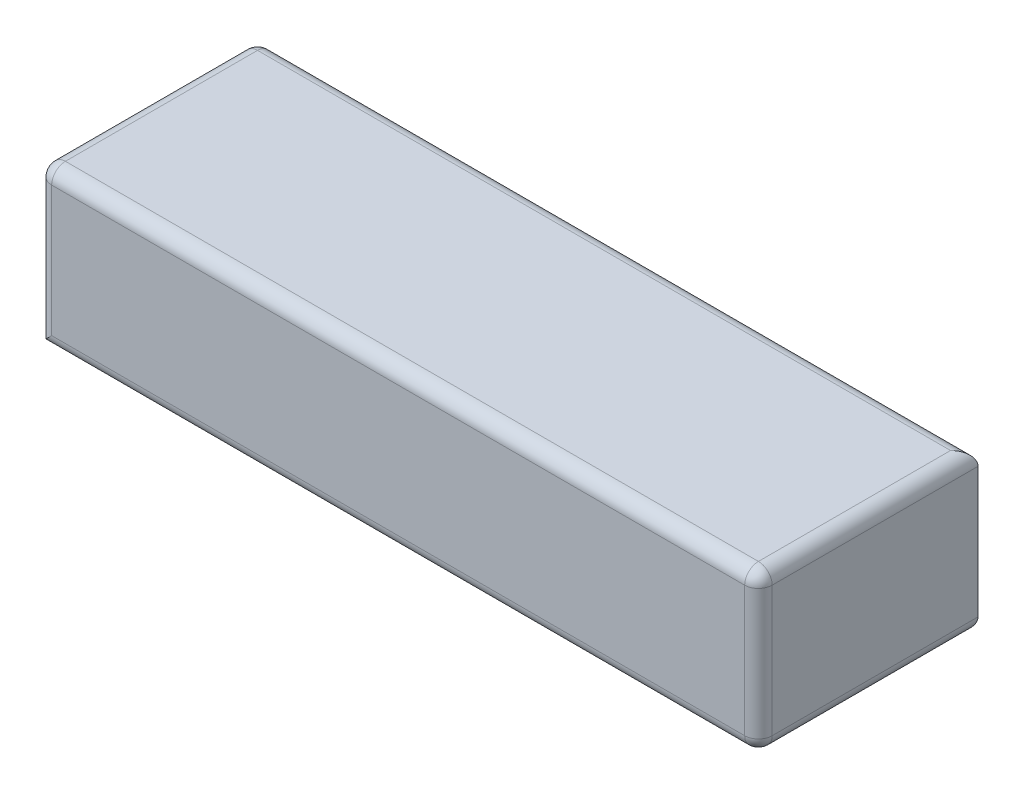
ISO-10303-21;
HEADER;
FILE_DESCRIPTION(('STEP AP214'),'2;1');
FILE_NAME('part.step','',(''),(''),'','','');
FILE_SCHEMA(('AUTOMOTIVE_DESIGN { 1 0 10303 214 1 1 1 1 }'));
ENDSEC;
DATA;
#1=APPLICATION_CONTEXT('core data for automotive mechanical design processes');
#2=APPLICATION_PROTOCOL_DEFINITION('international standard','automotive_design',2000,#1);
#3=PRODUCT_CONTEXT('',#1,'mechanical');
#4=PRODUCT('Part','Part','',(#3));
#5=PRODUCT_RELATED_PRODUCT_CATEGORY('part','',(#4));
#6=PRODUCT_DEFINITION_FORMATION('','',#4);
#7=PRODUCT_DEFINITION_CONTEXT('part definition',#1,'design');
#8=PRODUCT_DEFINITION('design','',#6,#7);
#9=PRODUCT_DEFINITION_SHAPE('','',#8);
#10=(LENGTH_UNIT() NAMED_UNIT(*) SI_UNIT(.MILLI.,.METRE.));
#11=(NAMED_UNIT(*) PLANE_ANGLE_UNIT() SI_UNIT($,.RADIAN.));
#12=(NAMED_UNIT(*) SI_UNIT($,.STERADIAN.) SOLID_ANGLE_UNIT());
#13=UNCERTAINTY_MEASURE_WITH_UNIT(LENGTH_MEASURE(1.E-05),#10,'distance_accuracy_value','');
#14=(GEOMETRIC_REPRESENTATION_CONTEXT(3) GLOBAL_UNCERTAINTY_ASSIGNED_CONTEXT((#13)) GLOBAL_UNIT_ASSIGNED_CONTEXT((#10,
#11,#12)) REPRESENTATION_CONTEXT('',''));
#15=CARTESIAN_POINT('',(0.,0.,0.));
#16=DIRECTION('',(0.,0.,1.));
#17=DIRECTION('',(1.,0.,0.));
#18=AXIS2_PLACEMENT_3D('',#15,#16,#17);
#19=CARTESIAN_POINT('',(52.5,23.,16.));
#20=DIRECTION('',(-1.,0.,0.));
#21=DIRECTION('',(0.,0.,1.));
#22=AXIS2_PLACEMENT_3D('',#19,#20,#21);
#23=PLANE('',#22);
#24=DIRECTION('',(0.,-1.,0.));
#25=VECTOR('',#24,1.);
#26=CARTESIAN_POINT('',(52.5,23.,-16.));
#27=LINE('',#26,#25);
#28=CARTESIAN_POINT('',(52.5,21.,-16.));
#29=VERTEX_POINT('',#28);
#30=CARTESIAN_POINT('',(52.5,2.,-16.));
#31=VERTEX_POINT('',#30);
#32=EDGE_CURVE('E140',#29,#31,#27,.T.);
#33=ORIENTED_EDGE('',*,*,#32,.F.);
#34=DIRECTION('',(0.,0.,-1.));
#35=VECTOR('',#34,1.);
#36=CARTESIAN_POINT('',(52.5,21.,16.));
#37=LINE('',#36,#35);
#38=CARTESIAN_POINT('',(52.5,21.,14.));
#39=VERTEX_POINT('',#38);
#40=EDGE_CURVE('E175',#29,#39,#37,.F.);
#41=ORIENTED_EDGE('',*,*,#40,.T.);
#42=DIRECTION('',(0.,-1.,0.));
#43=VECTOR('',#42,1.);
#44=CARTESIAN_POINT('',(52.5,23.,14.));
#45=LINE('',#44,#43);
#46=CARTESIAN_POINT('',(52.5,2.,14.));
#47=VERTEX_POINT('',#46);
#48=EDGE_CURVE('E173',#39,#47,#45,.T.);
#49=ORIENTED_EDGE('',*,*,#48,.T.);
#50=DIRECTION('',(0.,0.,-1.));
#51=VECTOR('',#50,1.);
#52=CARTESIAN_POINT('',(52.5,2.,-16.));
#53=LINE('',#52,#51);
#54=EDGE_CURVE('E171',#47,#31,#53,.T.);
#55=ORIENTED_EDGE('',*,*,#54,.T.);
#56=EDGE_LOOP('',(#33,#41,#49,#55));
#57=FACE_BOUND('',#56,.T.);
#58=ADVANCED_FACE('F34',(#57),#23,.F.);
#59=CARTESIAN_POINT('',(-52.5,23.,-16.));
#60=DIRECTION('',(0.,0.,1.));
#61=DIRECTION('',(1.,0.,0.));
#62=AXIS2_PLACEMENT_3D('',#59,#60,#61);
#63=PLANE('',#62);
#64=DIRECTION('',(0.,-1.,0.));
#65=VECTOR('',#64,1.);
#66=CARTESIAN_POINT('',(-50.5,23.,-16.));
#67=LINE('',#66,#65);
#68=CARTESIAN_POINT('',(-50.5,2.,-16.));
#69=VERTEX_POINT('',#68);
#70=CARTESIAN_POINT('',(-50.5,21.,-16.));
#71=VERTEX_POINT('',#70);
#72=EDGE_CURVE('E166',#69,#71,#67,.F.);
#73=ORIENTED_EDGE('',*,*,#72,.T.);
#74=DIRECTION('',(-1.,0.,0.));
#75=VECTOR('',#74,1.);
#76=CARTESIAN_POINT('',(-52.5,21.,-16.));
#77=LINE('',#76,#75);
#78=EDGE_CURVE('E168',#71,#29,#77,.F.);
#79=ORIENTED_EDGE('',*,*,#78,.T.);
#80=ORIENTED_EDGE('',*,*,#32,.T.);
#81=DIRECTION('',(-1.,0.,0.));
#82=VECTOR('',#81,1.);
#83=CARTESIAN_POINT('',(-52.5,2.,-16.));
#84=LINE('',#83,#82);
#85=EDGE_CURVE('E164',#31,#69,#84,.T.);
#86=ORIENTED_EDGE('',*,*,#85,.T.);
#87=EDGE_LOOP('',(#73,#79,#80,#86));
#88=FACE_BOUND('',#87,.T.);
#89=ADVANCED_FACE('F262',(#88),#63,.F.);
#90=CARTESIAN_POINT('',(-52.5,23.,16.));
#91=DIRECTION('',(1.,0.,0.));
#92=DIRECTION('',(0.,0.,-1.));
#93=AXIS2_PLACEMENT_3D('',#90,#91,#92);
#94=PLANE('',#93);
#95=DIRECTION('',(0.,0.,1.));
#96=VECTOR('',#95,1.);
#97=CARTESIAN_POINT('',(-52.5,21.,16.));
#98=LINE('',#97,#96);
#99=CARTESIAN_POINT('',(-52.5,21.,14.));
#100=VERTEX_POINT('',#99);
#101=CARTESIAN_POINT('',(-52.5,21.,-14.));
#102=VERTEX_POINT('',#101);
#103=EDGE_CURVE('E159',#100,#102,#98,.F.);
#104=ORIENTED_EDGE('',*,*,#103,.T.);
#105=DIRECTION('',(0.,-1.,0.));
#106=VECTOR('',#105,1.);
#107=CARTESIAN_POINT('',(-52.5,23.,-14.));
#108=LINE('',#107,#106);
#109=CARTESIAN_POINT('',(-52.5,0.,-14.));
#110=VERTEX_POINT('',#109);
#111=EDGE_CURVE('E162',#102,#110,#108,.T.);
#112=ORIENTED_EDGE('',*,*,#111,.T.);
#113=DIRECTION('',(0.,0.,1.));
#114=VECTOR('',#113,1.);
#115=CARTESIAN_POINT('',(-52.5,0.,16.));
#116=LINE('',#115,#114);
#117=CARTESIAN_POINT('',(-52.5,0.,14.));
#118=VERTEX_POINT('',#117);
#119=EDGE_CURVE('E211',#110,#118,#116,.T.);
#120=ORIENTED_EDGE('',*,*,#119,.T.);
#121=DIRECTION('',(0.,-1.,0.));
#122=VECTOR('',#121,1.);
#123=CARTESIAN_POINT('',(-52.5,23.,14.));
#124=LINE('',#123,#122);
#125=EDGE_CURVE('E157',#118,#100,#124,.F.);
#126=ORIENTED_EDGE('',*,*,#125,.T.);
#127=EDGE_LOOP('',(#104,#112,#120,#126));
#128=FACE_BOUND('',#127,.T.);
#129=ADVANCED_FACE('F264',(#128),#94,.F.);
#130=CARTESIAN_POINT('',(-52.5,23.,16.));
#131=DIRECTION('',(0.,0.,-1.));
#132=DIRECTION('',(-1.,0.,0.));
#133=AXIS2_PLACEMENT_3D('',#130,#131,#132);
#134=PLANE('',#133);
#135=DIRECTION('',(0.,-1.,0.));
#136=VECTOR('',#135,1.);
#137=CARTESIAN_POINT('',(50.5,23.,16.));
#138=LINE('',#137,#136);
#139=CARTESIAN_POINT('',(50.5,2.,16.));
#140=VERTEX_POINT('',#139);
#141=CARTESIAN_POINT('',(50.5,21.,16.));
#142=VERTEX_POINT('',#141);
#143=EDGE_CURVE('E146',#140,#142,#138,.F.);
#144=ORIENTED_EDGE('',*,*,#143,.T.);
#145=DIRECTION('',(1.,0.,0.));
#146=VECTOR('',#145,1.);
#147=CARTESIAN_POINT('',(-52.5,21.,16.));
#148=LINE('',#147,#146);
#149=CARTESIAN_POINT('',(-50.5,21.,16.));
#150=VERTEX_POINT('',#149);
#151=EDGE_CURVE('E118',#142,#150,#148,.F.);
#152=ORIENTED_EDGE('',*,*,#151,.T.);
#153=DIRECTION('',(0.,-1.,0.));
#154=VECTOR('',#153,1.);
#155=CARTESIAN_POINT('',(-50.5,23.,16.));
#156=LINE('',#155,#154);
#157=CARTESIAN_POINT('',(-50.5,2.,16.));
#158=VERTEX_POINT('',#157);
#159=EDGE_CURVE('E154',#150,#158,#156,.T.);
#160=ORIENTED_EDGE('',*,*,#159,.T.);
#161=DIRECTION('',(1.,0.,0.));
#162=VECTOR('',#161,1.);
#163=CARTESIAN_POINT('',(52.5,2.,16.));
#164=LINE('',#163,#162);
#165=EDGE_CURVE('E148',#158,#140,#164,.T.);
#166=ORIENTED_EDGE('',*,*,#165,.T.);
#167=EDGE_LOOP('',(#144,#152,#160,#166));
#168=FACE_BOUND('',#167,.T.);
#169=ADVANCED_FACE('F243',(#168),#134,.F.);
#170=CARTESIAN_POINT('',(0.,23.,0.));
#171=DIRECTION('',(0.,-1.,0.));
#172=DIRECTION('',(0.,0.,-1.));
#173=AXIS2_PLACEMENT_3D('',#170,#171,#172);
#174=PLANE('',#173);
#175=DIRECTION('',(0.,0.,1.));
#176=VECTOR('',#175,1.);
#177=CARTESIAN_POINT('',(-50.5,23.,0.));
#178=LINE('',#177,#176);
#179=CARTESIAN_POINT('',(-50.5,23.,-14.));
#180=VERTEX_POINT('',#179);
#181=CARTESIAN_POINT('',(-50.5,23.,14.));
#182=VERTEX_POINT('',#181);
#183=EDGE_CURVE('E144',#180,#182,#178,.T.);
#184=ORIENTED_EDGE('',*,*,#183,.T.);
#185=DIRECTION('',(1.,0.,0.));
#186=VECTOR('',#185,1.);
#187=CARTESIAN_POINT('',(0.,23.,14.));
#188=LINE('',#187,#186);
#189=CARTESIAN_POINT('',(50.5,23.,14.));
#190=VERTEX_POINT('',#189);
#191=EDGE_CURVE('E116',#182,#190,#188,.T.);
#192=ORIENTED_EDGE('',*,*,#191,.T.);
#193=DIRECTION('',(0.,0.,-1.));
#194=VECTOR('',#193,1.);
#195=CARTESIAN_POINT('',(50.5,23.,0.));
#196=LINE('',#195,#194);
#197=CARTESIAN_POINT('',(50.5,23.,-14.));
#198=VERTEX_POINT('',#197);
#199=EDGE_CURVE('E133',#190,#198,#196,.T.);
#200=ORIENTED_EDGE('',*,*,#199,.T.);
#201=DIRECTION('',(-1.,0.,0.));
#202=VECTOR('',#201,1.);
#203=CARTESIAN_POINT('',(0.,23.,-14.));
#204=LINE('',#203,#202);
#205=EDGE_CURVE('E139',#198,#180,#204,.T.);
#206=ORIENTED_EDGE('',*,*,#205,.T.);
#207=EDGE_LOOP('',(#184,#192,#200,#206));
#208=FACE_BOUND('',#207,.T.);
#209=ADVANCED_FACE('F142',(#208),#174,.F.);
#210=CARTESIAN_POINT('',(0.,0.,0.));
#211=DIRECTION('',(0.,-1.,0.));
#212=DIRECTION('',(0.,0.,-1.));
#213=AXIS2_PLACEMENT_3D('',#210,#211,#212);
#214=PLANE('',#213);
#215=DIRECTION('',(0.,0.,-1.));
#216=VECTOR('',#215,1.);
#217=CARTESIAN_POINT('',(50.5,0.,16.));
#218=LINE('',#217,#216);
#219=CARTESIAN_POINT('',(50.5,0.,-14.));
#220=VERTEX_POINT('',#219);
#221=CARTESIAN_POINT('',(50.5,0.,14.));
#222=VERTEX_POINT('',#221);
#223=EDGE_CURVE('E50',#220,#222,#218,.F.);
#224=ORIENTED_EDGE('',*,*,#223,.T.);
#225=DIRECTION('',(1.,0.,0.));
#226=VECTOR('',#225,1.);
#227=CARTESIAN_POINT('',(-52.5,0.,14.));
#228=LINE('',#227,#226);
#229=EDGE_CURVE('E11',#222,#118,#228,.F.);
#230=ORIENTED_EDGE('',*,*,#229,.T.);
#231=ORIENTED_EDGE('',*,*,#119,.F.);
#232=DIRECTION('',(-1.,0.,0.));
#233=VECTOR('',#232,1.);
#234=CARTESIAN_POINT('',(52.5,0.,-14.));
#235=LINE('',#234,#233);
#236=EDGE_CURVE('E43',#110,#220,#235,.F.);
#237=ORIENTED_EDGE('',*,*,#236,.T.);
#238=EDGE_LOOP('',(#224,#230,#231,#237));
#239=FACE_BOUND('',#238,.T.);
#240=ADVANCED_FACE('F258',(#239),#214,.T.);
#241=CARTESIAN_POINT('',(-52.5,2.,-14.));
#242=DIRECTION('',(1.,0.,0.));
#243=DIRECTION('',(0.,0.,-1.));
#244=AXIS2_PLACEMENT_3D('',#241,#242,#243);
#245=CYLINDRICAL_SURFACE('',#244,2.);
#246=CARTESIAN_POINT('',(50.5,2.,-14.));
#247=DIRECTION('',(0.707106781186547,0.,0.707106781186547));
#248=DIRECTION('',(-0.707106781186547,0.,0.707106781186547));
#249=AXIS2_PLACEMENT_3D('',#246,#247,#248);
#250=ELLIPSE('',#249,2.82842712474619,2.);
#251=EDGE_CURVE('E206',#220,#31,#250,.T.);
#252=ORIENTED_EDGE('',*,*,#251,.F.);
#253=ORIENTED_EDGE('',*,*,#236,.F.);
#254=CARTESIAN_POINT('',(-50.5,2.,-14.));
#255=DIRECTION('',(0.707106781186547,-0.707106781186547,0.));
#256=DIRECTION('',(0.707106781186547,0.707106781186547,0.));
#257=AXIS2_PLACEMENT_3D('',#254,#255,#256);
#258=ELLIPSE('',#257,2.82842712474619,2.);
#259=EDGE_CURVE('E38',#69,#110,#258,.F.);
#260=ORIENTED_EDGE('',*,*,#259,.F.);
#261=ORIENTED_EDGE('',*,*,#85,.F.);
#262=EDGE_LOOP('',(#252,#253,#260,#261));
#263=FACE_BOUND('',#262,.T.);
#264=ADVANCED_FACE('F36',(#263),#245,.T.);
#265=CARTESIAN_POINT('',(-50.5,23.,-14.));
#266=DIRECTION('',(0.,-1.,0.));
#267=DIRECTION('',(0.,0.,-1.));
#268=AXIS2_PLACEMENT_3D('',#265,#266,#267);
#269=CYLINDRICAL_SURFACE('',#268,2.);
#270=ORIENTED_EDGE('',*,*,#259,.T.);
#271=ORIENTED_EDGE('',*,*,#111,.F.);
#272=CARTESIAN_POINT('',(-50.5,21.,-14.));
#273=DIRECTION('',(0.,1.,0.));
#274=DIRECTION('',(0.,0.,1.));
#275=AXIS2_PLACEMENT_3D('',#272,#273,#274);
#276=CIRCLE('',#275,2.);
#277=EDGE_CURVE('E204',#71,#102,#276,.T.);
#278=ORIENTED_EDGE('',*,*,#277,.F.);
#279=ORIENTED_EDGE('',*,*,#72,.F.);
#280=EDGE_LOOP('',(#270,#271,#278,#279));
#281=FACE_BOUND('',#280,.T.);
#282=ADVANCED_FACE('F263',(#281),#269,.T.);
#283=CARTESIAN_POINT('',(50.5,2.,16.));
#284=DIRECTION('',(0.,0.,1.));
#285=DIRECTION('',(1.,0.,0.));
#286=AXIS2_PLACEMENT_3D('',#283,#284,#285);
#287=CYLINDRICAL_SURFACE('',#286,2.);
#288=ORIENTED_EDGE('',*,*,#251,.T.);
#289=ORIENTED_EDGE('',*,*,#54,.F.);
#290=CARTESIAN_POINT('',(50.5,2.,14.));
#291=DIRECTION('',(0.,0.,1.));
#292=DIRECTION('',(1.,0.,0.));
#293=AXIS2_PLACEMENT_3D('',#290,#291,#292);
#294=CIRCLE('',#293,2.);
#295=EDGE_CURVE('E198',#222,#47,#294,.T.);
#296=ORIENTED_EDGE('',*,*,#295,.F.);
#297=ORIENTED_EDGE('',*,*,#223,.F.);
#298=EDGE_LOOP('',(#288,#289,#296,#297));
#299=FACE_BOUND('',#298,.T.);
#300=ADVANCED_FACE('F253',(#299),#287,.T.);
#301=CARTESIAN_POINT('',(-52.5,2.,14.));
#302=DIRECTION('',(-1.,0.,0.));
#303=DIRECTION('',(0.,0.,1.));
#304=AXIS2_PLACEMENT_3D('',#301,#302,#303);
#305=CYLINDRICAL_SURFACE('',#304,2.);
#306=CARTESIAN_POINT('',(-50.5,2.,14.));
#307=DIRECTION('',(-0.707106781186547,0.707106781186547,0.));
#308=DIRECTION('',(-0.707106781186547,-0.707106781186547,0.));
#309=AXIS2_PLACEMENT_3D('',#306,#307,#308);
#310=ELLIPSE('',#309,2.82842712474619,2.);
#311=EDGE_CURVE('E192',#118,#158,#310,.T.);
#312=ORIENTED_EDGE('',*,*,#311,.F.);
#313=ORIENTED_EDGE('',*,*,#229,.F.);
#314=CARTESIAN_POINT('',(50.5,2.,14.));
#315=DIRECTION('',(1.,0.,0.));
#316=DIRECTION('',(0.,0.,-1.));
#317=AXIS2_PLACEMENT_3D('',#314,#315,#316);
#318=CIRCLE('',#317,2.);
#319=EDGE_CURVE('E195',#140,#222,#318,.T.);
#320=ORIENTED_EDGE('',*,*,#319,.F.);
#321=ORIENTED_EDGE('',*,*,#165,.F.);
#322=EDGE_LOOP('',(#312,#313,#320,#321));
#323=FACE_BOUND('',#322,.T.);
#324=ADVANCED_FACE('F257',(#323),#305,.T.);
#325=CARTESIAN_POINT('',(-50.5,21.,-14.));
#326=DIRECTION('',(0.,0.,1.));
#327=DIRECTION('',(1.,0.,0.));
#328=AXIS2_PLACEMENT_3D('',#325,#326,#327);
#329=SPHERICAL_SURFACE('',#328,2.);
#330=CARTESIAN_POINT('',(-50.5,21.,-14.));
#331=DIRECTION('',(0.,0.,-1.));
#332=DIRECTION('',(0.,1.,0.));
#333=AXIS2_PLACEMENT_3D('',#330,#331,#332);
#334=CIRCLE('',#333,2.);
#335=EDGE_CURVE('E190',#180,#102,#334,.F.);
#336=ORIENTED_EDGE('',*,*,#335,.F.);
#337=CARTESIAN_POINT('',(-50.5,21.,-14.));
#338=DIRECTION('',(-1.,0.,0.));
#339=DIRECTION('',(0.,0.,1.));
#340=AXIS2_PLACEMENT_3D('',#337,#338,#339);
#341=CIRCLE('',#340,2.);
#342=EDGE_CURVE('E201',#71,#180,#341,.F.);
#343=ORIENTED_EDGE('',*,*,#342,.F.);
#344=ORIENTED_EDGE('',*,*,#277,.T.);
#345=EDGE_LOOP('',(#336,#343,#344));
#346=FACE_BOUND('',#345,.T.);
#347=ADVANCED_FACE('F228',(#346),#329,.T.);
#348=CARTESIAN_POINT('',(0.,21.,-14.));
#349=DIRECTION('',(-1.,0.,0.));
#350=DIRECTION('',(0.,0.,1.));
#351=AXIS2_PLACEMENT_3D('',#348,#349,#350);
#352=CYLINDRICAL_SURFACE('',#351,2.);
#353=ORIENTED_EDGE('',*,*,#342,.T.);
#354=ORIENTED_EDGE('',*,*,#205,.F.);
#355=CARTESIAN_POINT('',(50.5,21.,-14.));
#356=DIRECTION('',(-0.707106781186547,0.,-0.707106781186547));
#357=DIRECTION('',(0.707106781186547,0.,-0.707106781186547));
#358=AXIS2_PLACEMENT_3D('',#355,#356,#357);
#359=ELLIPSE('',#358,2.82842712474619,2.);
#360=EDGE_CURVE('E136',#29,#198,#359,.F.);
#361=ORIENTED_EDGE('',*,*,#360,.F.);
#362=ORIENTED_EDGE('',*,*,#78,.F.);
#363=EDGE_LOOP('',(#353,#354,#361,#362));
#364=FACE_BOUND('',#363,.T.);
#365=ADVANCED_FACE('F226',(#364),#352,.T.);
#366=CARTESIAN_POINT('',(50.5,2.,14.));
#367=DIRECTION('',(0.,0.,1.));
#368=DIRECTION('',(1.,0.,0.));
#369=AXIS2_PLACEMENT_3D('',#366,#367,#368);
#370=SPHERICAL_SURFACE('',#369,2.);
#371=ORIENTED_EDGE('',*,*,#319,.T.);
#372=ORIENTED_EDGE('',*,*,#295,.T.);
#373=CARTESIAN_POINT('',(50.5,2.,14.));
#374=DIRECTION('',(0.,-1.,0.));
#375=DIRECTION('',(0.,0.,-1.));
#376=AXIS2_PLACEMENT_3D('',#373,#374,#375);
#377=CIRCLE('',#376,2.);
#378=EDGE_CURVE('E186',#140,#47,#377,.F.);
#379=ORIENTED_EDGE('',*,*,#378,.F.);
#380=EDGE_LOOP('',(#371,#372,#379));
#381=FACE_BOUND('',#380,.T.);
#382=ADVANCED_FACE('F255',(#381),#370,.T.);
#383=CARTESIAN_POINT('',(-50.5,23.,14.));
#384=DIRECTION('',(0.,-1.,0.));
#385=DIRECTION('',(0.,0.,-1.));
#386=AXIS2_PLACEMENT_3D('',#383,#384,#385);
#387=CYLINDRICAL_SURFACE('',#386,2.);
#388=ORIENTED_EDGE('',*,*,#311,.T.);
#389=ORIENTED_EDGE('',*,*,#159,.F.);
#390=CARTESIAN_POINT('',(-50.5,21.,14.));
#391=DIRECTION('',(0.,1.,0.));
#392=DIRECTION('',(0.,0.,1.));
#393=AXIS2_PLACEMENT_3D('',#390,#391,#392);
#394=CIRCLE('',#393,2.);
#395=EDGE_CURVE('E183',#100,#150,#394,.T.);
#396=ORIENTED_EDGE('',*,*,#395,.F.);
#397=ORIENTED_EDGE('',*,*,#125,.F.);
#398=EDGE_LOOP('',(#388,#389,#396,#397));
#399=FACE_BOUND('',#398,.T.);
#400=ADVANCED_FACE('F240',(#399),#387,.T.);
#401=CARTESIAN_POINT('',(-50.5,21.,0.));
#402=DIRECTION('',(0.,0.,1.));
#403=DIRECTION('',(1.,0.,0.));
#404=AXIS2_PLACEMENT_3D('',#401,#402,#403);
#405=CYLINDRICAL_SURFACE('',#404,2.);
#406=ORIENTED_EDGE('',*,*,#335,.T.);
#407=ORIENTED_EDGE('',*,*,#103,.F.);
#408=CARTESIAN_POINT('',(-50.5,21.,14.));
#409=DIRECTION('',(0.,0.,1.));
#410=DIRECTION('',(1.,0.,0.));
#411=AXIS2_PLACEMENT_3D('',#408,#409,#410);
#412=CIRCLE('',#411,2.);
#413=EDGE_CURVE('E130',#182,#100,#412,.T.);
#414=ORIENTED_EDGE('',*,*,#413,.F.);
#415=ORIENTED_EDGE('',*,*,#183,.F.);
#416=EDGE_LOOP('',(#406,#407,#414,#415));
#417=FACE_BOUND('',#416,.T.);
#418=ADVANCED_FACE('F232',(#417),#405,.T.);
#419=CARTESIAN_POINT('',(50.5,21.,0.));
#420=DIRECTION('',(0.,0.,-1.));
#421=DIRECTION('',(-1.,0.,0.));
#422=AXIS2_PLACEMENT_3D('',#419,#420,#421);
#423=CYLINDRICAL_SURFACE('',#422,2.);
#424=ORIENTED_EDGE('',*,*,#360,.T.);
#425=ORIENTED_EDGE('',*,*,#199,.F.);
#426=CARTESIAN_POINT('',(50.5,21.,14.));
#427=DIRECTION('',(0.,0.,1.));
#428=DIRECTION('',(1.,0.,0.));
#429=AXIS2_PLACEMENT_3D('',#426,#427,#428);
#430=CIRCLE('',#429,2.);
#431=EDGE_CURVE('E124',#39,#190,#430,.T.);
#432=ORIENTED_EDGE('',*,*,#431,.F.);
#433=ORIENTED_EDGE('',*,*,#40,.F.);
#434=EDGE_LOOP('',(#424,#425,#432,#433));
#435=FACE_BOUND('',#434,.T.);
#436=ADVANCED_FACE('F134',(#435),#423,.T.);
#437=CARTESIAN_POINT('',(50.5,23.,14.));
#438=DIRECTION('',(0.,-1.,0.));
#439=DIRECTION('',(0.,0.,-1.));
#440=AXIS2_PLACEMENT_3D('',#437,#438,#439);
#441=CYLINDRICAL_SURFACE('',#440,2.);
#442=ORIENTED_EDGE('',*,*,#378,.T.);
#443=ORIENTED_EDGE('',*,*,#48,.F.);
#444=CARTESIAN_POINT('',(50.5,21.,14.));
#445=DIRECTION('',(0.,1.,0.));
#446=DIRECTION('',(0.,0.,1.));
#447=AXIS2_PLACEMENT_3D('',#444,#445,#446);
#448=CIRCLE('',#447,2.);
#449=EDGE_CURVE('E128',#142,#39,#448,.T.);
#450=ORIENTED_EDGE('',*,*,#449,.F.);
#451=ORIENTED_EDGE('',*,*,#143,.F.);
#452=EDGE_LOOP('',(#442,#443,#450,#451));
#453=FACE_BOUND('',#452,.T.);
#454=ADVANCED_FACE('F248',(#453),#441,.T.);
#455=CARTESIAN_POINT('',(-50.5,21.,14.));
#456=DIRECTION('',(0.,0.,1.));
#457=DIRECTION('',(1.,0.,0.));
#458=AXIS2_PLACEMENT_3D('',#455,#456,#457);
#459=SPHERICAL_SURFACE('',#458,2.);
#460=ORIENTED_EDGE('',*,*,#413,.T.);
#461=ORIENTED_EDGE('',*,*,#395,.T.);
#462=CARTESIAN_POINT('',(-50.5,21.,14.));
#463=DIRECTION('',(-1.,0.,0.));
#464=DIRECTION('',(0.,0.,1.));
#465=AXIS2_PLACEMENT_3D('',#462,#463,#464);
#466=CIRCLE('',#465,2.);
#467=EDGE_CURVE('E121',#182,#150,#466,.F.);
#468=ORIENTED_EDGE('',*,*,#467,.F.);
#469=EDGE_LOOP('',(#460,#461,#468));
#470=FACE_BOUND('',#469,.T.);
#471=ADVANCED_FACE('F236',(#470),#459,.T.);
#472=CARTESIAN_POINT('',(50.5,21.,14.));
#473=DIRECTION('',(0.,0.,1.));
#474=DIRECTION('',(1.,0.,0.));
#475=AXIS2_PLACEMENT_3D('',#472,#473,#474);
#476=SPHERICAL_SURFACE('',#475,2.);
#477=ORIENTED_EDGE('',*,*,#449,.T.);
#478=ORIENTED_EDGE('',*,*,#431,.T.);
#479=CARTESIAN_POINT('',(50.5,21.,14.));
#480=DIRECTION('',(1.,0.,0.));
#481=DIRECTION('',(0.,0.,-1.));
#482=AXIS2_PLACEMENT_3D('',#479,#480,#481);
#483=CIRCLE('',#482,2.);
#484=EDGE_CURVE('E112',#142,#190,#483,.F.);
#485=ORIENTED_EDGE('',*,*,#484,.F.);
#486=EDGE_LOOP('',(#477,#478,#485));
#487=FACE_BOUND('',#486,.T.);
#488=ADVANCED_FACE('F126',(#487),#476,.T.);
#489=CARTESIAN_POINT('',(0.,21.,14.));
#490=DIRECTION('',(1.,0.,0.));
#491=DIRECTION('',(0.,0.,-1.));
#492=AXIS2_PLACEMENT_3D('',#489,#490,#491);
#493=CYLINDRICAL_SURFACE('',#492,2.);
#494=ORIENTED_EDGE('',*,*,#467,.T.);
#495=ORIENTED_EDGE('',*,*,#151,.F.);
#496=ORIENTED_EDGE('',*,*,#484,.T.);
#497=ORIENTED_EDGE('',*,*,#191,.F.);
#498=EDGE_LOOP('',(#494,#495,#496,#497));
#499=FACE_BOUND('',#498,.T.);
#500=ADVANCED_FACE('F114',(#499),#493,.T.);
#501=CLOSED_SHELL('',(#58,#89,#129,#169,#209,#240,#264,#282,#300,#324,#347,#365,#382,#400,#418,
#436,#454,#471,#488,#500));
#502=MANIFOLD_SOLID_BREP('B2',#501);
#503=ADVANCED_BREP_SHAPE_REPRESENTATION('',(#18,#502),#14);
#504=SHAPE_DEFINITION_REPRESENTATION(#9,#503);
ENDSEC;
END-ISO-10303-21;
